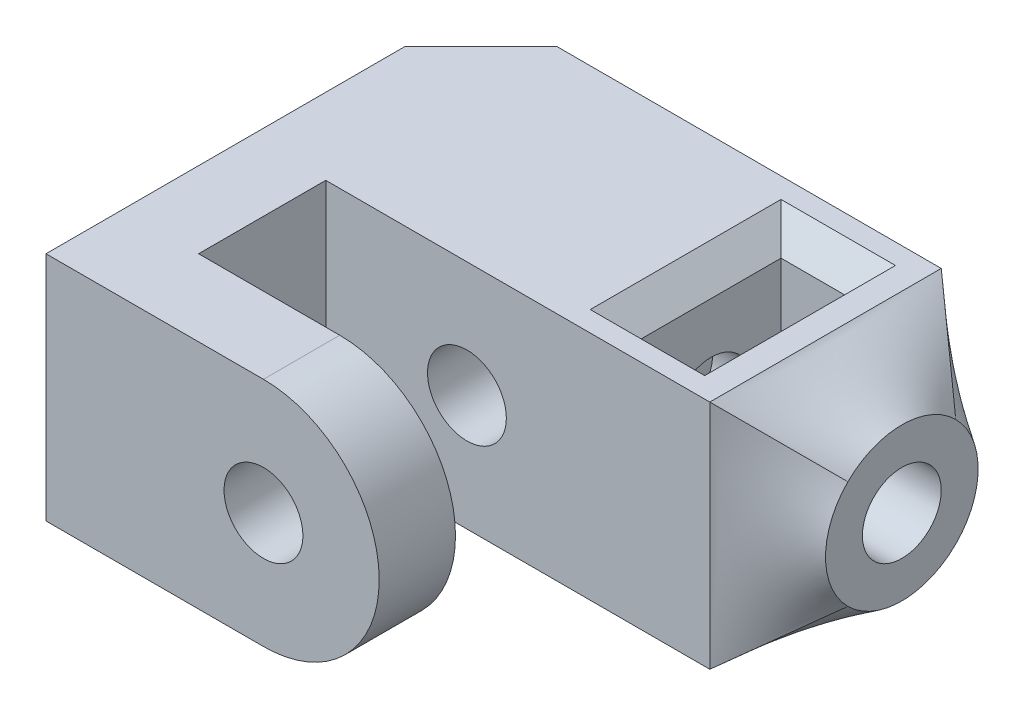
ISO-10303-21;
HEADER;
FILE_DESCRIPTION(('STEP AP214'),'2;1');
FILE_NAME('part.step','',(''),(''),'','','');
FILE_SCHEMA(('AUTOMOTIVE_DESIGN { 1 0 10303 214 1 1 1 1 }'));
ENDSEC;
DATA;
#1=APPLICATION_CONTEXT('core data for automotive mechanical design processes');
#2=APPLICATION_PROTOCOL_DEFINITION('international standard','automotive_design',2000,#1);
#3=PRODUCT_CONTEXT('',#1,'mechanical');
#4=PRODUCT('Part','Part','',(#3));
#5=PRODUCT_RELATED_PRODUCT_CATEGORY('part','',(#4));
#6=PRODUCT_DEFINITION_FORMATION('','',#4);
#7=PRODUCT_DEFINITION_CONTEXT('part definition',#1,'design');
#8=PRODUCT_DEFINITION('design','',#6,#7);
#9=PRODUCT_DEFINITION_SHAPE('','',#8);
#10=(LENGTH_UNIT() NAMED_UNIT(*) SI_UNIT(.MILLI.,.METRE.));
#11=(NAMED_UNIT(*) PLANE_ANGLE_UNIT() SI_UNIT($,.RADIAN.));
#12=(NAMED_UNIT(*) SI_UNIT($,.STERADIAN.) SOLID_ANGLE_UNIT());
#13=UNCERTAINTY_MEASURE_WITH_UNIT(LENGTH_MEASURE(1.E-05),#10,'distance_accuracy_value','');
#14=(GEOMETRIC_REPRESENTATION_CONTEXT(3) GLOBAL_UNCERTAINTY_ASSIGNED_CONTEXT((#13)) GLOBAL_UNIT_ASSIGNED_CONTEXT((#10,
#11,#12)) REPRESENTATION_CONTEXT('',''));
#15=CARTESIAN_POINT('',(0.,0.,0.));
#16=DIRECTION('',(0.,0.,1.));
#17=DIRECTION('',(1.,0.,0.));
#18=AXIS2_PLACEMENT_3D('',#15,#16,#17);
#19=CARTESIAN_POINT('',(-107.11518965689,2.50000000001586,-20.55));
#20=DIRECTION('',(1.,0.,0.));
#21=DIRECTION('',(0.,0.,1.));
#22=AXIS2_PLACEMENT_3D('',#19,#20,#21);
#23=CYLINDRICAL_SURFACE('',#22,1.55);
#24=CARTESIAN_POINT('',(-82.0141896568897,2.50000000001586,-20.55));
#25=DIRECTION('',(-1.,0.,0.));
#26=DIRECTION('',(0.,0.,1.));
#27=AXIS2_PLACEMENT_3D('',#24,#25,#26);
#28=CIRCLE('',#27,1.55);
#29=CARTESIAN_POINT('',(-82.0141896568897,2.50000000001586,-19.));
#30=VERTEX_POINT('',#29);
#31=EDGE_CURVE('E190',#30,#30,#28,.T.);
#32=ORIENTED_EDGE('',*,*,#31,.F.);
#33=EDGE_LOOP('',(#32));
#34=FACE_BOUND('',#33,.T.);
#35=CARTESIAN_POINT('',(-87.0141896568897,2.50000000001586,-20.55));
#36=DIRECTION('',(1.,0.,0.));
#37=DIRECTION('',(0.,0.,-1.));
#38=AXIS2_PLACEMENT_3D('',#35,#36,#37);
#39=CIRCLE('',#38,1.55);
#40=CARTESIAN_POINT('',(-87.0141896568897,2.50000000001586,-22.1));
#41=VERTEX_POINT('',#40);
#42=EDGE_CURVE('E369',#41,#41,#39,.T.);
#43=ORIENTED_EDGE('',*,*,#42,.F.);
#44=EDGE_LOOP('',(#43));
#45=FACE_BOUND('',#44,.T.);
#46=ADVANCED_FACE('F39',(#34,#45),#23,.F.);
#47=CARTESIAN_POINT('',(-100.11418965689,0.,-16.));
#48=DIRECTION('',(-1.,0.,0.));
#49=DIRECTION('',(0.,0.,-1.));
#50=AXIS2_PLACEMENT_3D('',#47,#48,#49);
#51=PLANE('',#50);
#52=DIRECTION('',(0.,1.,0.));
#53=VECTOR('',#52,1.);
#54=CARTESIAN_POINT('',(-100.11418965689,0.,-11.));
#55=LINE('',#54,#53);
#56=CARTESIAN_POINT('',(-100.11418965689,-2.04999999998414,-11.));
#57=VERTEX_POINT('',#56);
#58=CARTESIAN_POINT('',(-100.11418965689,7.05000000001586,-11.));
#59=VERTEX_POINT('',#58);
#60=EDGE_CURVE('E285',#57,#59,#55,.T.);
#61=ORIENTED_EDGE('',*,*,#60,.F.);
#62=DIRECTION('',(0.,0.,-1.));
#63=VECTOR('',#62,1.);
#64=CARTESIAN_POINT('',(-100.11418965689,-2.04999999998414,-8.));
#65=LINE('',#64,#63);
#66=CARTESIAN_POINT('',(-100.11418965689,-2.04999999998414,-16.));
#67=VERTEX_POINT('',#66);
#68=EDGE_CURVE('E295',#57,#67,#65,.T.);
#69=ORIENTED_EDGE('',*,*,#68,.T.);
#70=DIRECTION('',(0.,-1.,0.));
#71=VECTOR('',#70,1.);
#72=CARTESIAN_POINT('',(-100.11418965689,0.,-16.));
#73=LINE('',#72,#71);
#74=CARTESIAN_POINT('',(-100.11418965689,7.05000000001586,-16.));
#75=VERTEX_POINT('',#74);
#76=EDGE_CURVE('E412',#75,#67,#73,.T.);
#77=ORIENTED_EDGE('',*,*,#76,.F.);
#78=DIRECTION('',(0.,0.,1.));
#79=VECTOR('',#78,1.);
#80=CARTESIAN_POINT('',(-100.11418965689,7.05000000001586,-8.));
#81=LINE('',#80,#79);
#82=EDGE_CURVE('E299',#75,#59,#81,.T.);
#83=ORIENTED_EDGE('',*,*,#82,.T.);
#84=EDGE_LOOP('',(#61,#69,#77,#83));
#85=FACE_BOUND('',#84,.T.);
#86=ADVANCED_FACE('F485',(#85),#51,.F.);
#87=CARTESIAN_POINT('',(0.,7.05000000001582,-25.1));
#88=DIRECTION('',(0.,1.,0.));
#89=DIRECTION('',(-1.,0.,0.));
#90=AXIS2_PLACEMENT_3D('',#87,#88,#89);
#91=PLANE('',#90);
#92=DIRECTION('',(0.,0.,1.));
#93=VECTOR('',#92,1.);
#94=CARTESIAN_POINT('',(-90.5141896568897,7.05000000001586,-17.8));
#95=LINE('',#94,#93);
#96=CARTESIAN_POINT('',(-90.5141896568897,7.05000000001586,-24.3));
#97=VERTEX_POINT('',#96);
#98=CARTESIAN_POINT('',(-90.5141896568897,7.05000000001586,-16.8));
#99=VERTEX_POINT('',#98);
#100=EDGE_CURVE('E326',#97,#99,#95,.T.);
#101=ORIENTED_EDGE('',*,*,#100,.F.);
#102=DIRECTION('',(-1.,0.,0.));
#103=VECTOR('',#102,1.);
#104=CARTESIAN_POINT('',(0.,7.05000000001582,-24.3));
#105=LINE('',#104,#103);
#106=CARTESIAN_POINT('',(-86.0141896568897,7.05000000001585,-24.3));
#107=VERTEX_POINT('',#106);
#108=EDGE_CURVE('E339',#107,#97,#105,.T.);
#109=ORIENTED_EDGE('',*,*,#108,.F.);
#110=DIRECTION('',(0.,0.,-1.));
#111=VECTOR('',#110,1.);
#112=CARTESIAN_POINT('',(-86.0141896568897,7.05000000001585,-25.1));
#113=LINE('',#112,#111);
#114=CARTESIAN_POINT('',(-86.0141896568897,7.05000000001586,-16.8));
#115=VERTEX_POINT('',#114);
#116=EDGE_CURVE('E342',#115,#107,#113,.T.);
#117=ORIENTED_EDGE('',*,*,#116,.F.);
#118=DIRECTION('',(1.,0.,0.));
#119=VECTOR('',#118,1.);
#120=CARTESIAN_POINT('',(0.,7.05000000001583,-16.8));
#121=LINE('',#120,#119);
#122=EDGE_CURVE('E345',#99,#115,#121,.T.);
#123=ORIENTED_EDGE('',*,*,#122,.F.);
#124=EDGE_LOOP('',(#101,#109,#117,#123));
#125=FACE_BOUND('',#124,.T.);
#126=DIRECTION('',(0.,0.,1.));
#127=VECTOR('',#126,1.);
#128=CARTESIAN_POINT('',(-103.11418965689,7.05000000001586,-8.));
#129=LINE('',#128,#127);
#130=CARTESIAN_POINT('',(-103.11418965689,7.05000000001586,-22.1));
#131=VERTEX_POINT('',#130);
#132=CARTESIAN_POINT('',(-103.11418965689,7.05000000001586,-8.));
#133=VERTEX_POINT('',#132);
#134=EDGE_CURVE('E302',#131,#133,#129,.T.);
#135=ORIENTED_EDGE('',*,*,#134,.T.);
#136=DIRECTION('',(1.,0.,0.));
#137=VECTOR('',#136,1.);
#138=CARTESIAN_POINT('',(-103.11418965689,7.05000000001586,-8.));
#139=LINE('',#138,#137);
#140=CARTESIAN_POINT('',(-94.5641896568897,7.05000000001586,-8.));
#141=VERTEX_POINT('',#140);
#142=EDGE_CURVE('E305',#133,#141,#139,.T.);
#143=ORIENTED_EDGE('',*,*,#142,.T.);
#144=DIRECTION('',(0.,0.,-1.));
#145=VECTOR('',#144,1.);
#146=CARTESIAN_POINT('',(-94.5641896568897,7.05000000001586,-8.));
#147=LINE('',#146,#145);
#148=CARTESIAN_POINT('',(-94.5641896568897,7.05000000001586,-11.));
#149=VERTEX_POINT('',#148);
#150=EDGE_CURVE('E292',#141,#149,#147,.T.);
#151=ORIENTED_EDGE('',*,*,#150,.T.);
#152=DIRECTION('',(1.,0.,0.));
#153=VECTOR('',#152,1.);
#154=CARTESIAN_POINT('',(0.,7.05000000001586,-11.));
#155=LINE('',#154,#153);
#156=EDGE_CURVE('E277',#59,#149,#155,.T.);
#157=ORIENTED_EDGE('',*,*,#156,.F.);
#158=ORIENTED_EDGE('',*,*,#82,.F.);
#159=DIRECTION('',(1.,0.,0.));
#160=VECTOR('',#159,1.);
#161=CARTESIAN_POINT('',(0.,7.05000000001583,-16.));
#162=LINE('',#161,#160);
#163=CARTESIAN_POINT('',(-85.0141896568897,7.05000000001586,-16.));
#164=VERTEX_POINT('',#163);
#165=EDGE_CURVE('E401',#75,#164,#162,.T.);
#166=ORIENTED_EDGE('',*,*,#165,.T.);
#167=DIRECTION('',(0.,0.,-1.));
#168=VECTOR('',#167,1.);
#169=CARTESIAN_POINT('',(-85.0141896568897,7.05000000001585,-25.1));
#170=LINE('',#169,#168);
#171=CARTESIAN_POINT('',(-85.0141896568897,7.05000000001585,-25.1));
#172=VERTEX_POINT('',#171);
#173=EDGE_CURVE('E327',#172,#164,#170,.F.);
#174=ORIENTED_EDGE('',*,*,#173,.F.);
#175=DIRECTION('',(1.,0.,0.));
#176=VECTOR('',#175,1.);
#177=CARTESIAN_POINT('',(0.,7.05000000001582,-25.1));
#178=LINE('',#177,#176);
#179=CARTESIAN_POINT('',(-100.11418965689,7.05000000001586,-25.1));
#180=VERTEX_POINT('',#179);
#181=EDGE_CURVE('E316',#180,#172,#178,.T.);
#182=ORIENTED_EDGE('',*,*,#181,.F.);
#183=DIRECTION('',(-0.707106781186548,0.,0.707106781186547));
#184=VECTOR('',#183,1.);
#185=CARTESIAN_POINT('',(-50.0570948284447,7.05000000001582,-75.1570948284448));
#186=LINE('',#185,#184);
#187=EDGE_CURVE('E371',#131,#180,#186,.F.);
#188=ORIENTED_EDGE('',*,*,#187,.F.);
#189=EDGE_LOOP('',(#135,#143,#151,#157,#158,#166,#174,#182,#188));
#190=FACE_BOUND('',#189,.T.);
#191=ADVANCED_FACE('F377',(#125,#190),#91,.T.);
#192=CARTESIAN_POINT('',(0.,-2.04999999998411,-25.1));
#193=DIRECTION('',(0.,1.,0.));
#194=DIRECTION('',(-1.,0.,0.));
#195=AXIS2_PLACEMENT_3D('',#192,#193,#194);
#196=PLANE('',#195);
#197=DIRECTION('',(1.,0.,0.));
#198=VECTOR('',#197,1.);
#199=CARTESIAN_POINT('',(0.,-2.04999999998411,-25.1));
#200=LINE('',#199,#198);
#201=CARTESIAN_POINT('',(-100.11418965689,-2.04999999998415,-25.1));
#202=VERTEX_POINT('',#201);
#203=CARTESIAN_POINT('',(-85.0141896568897,-2.04999999998414,-25.1));
#204=VERTEX_POINT('',#203);
#205=EDGE_CURVE('E318',#202,#204,#200,.T.);
#206=ORIENTED_EDGE('',*,*,#205,.T.);
#207=DIRECTION('',(0.,0.,-1.));
#208=VECTOR('',#207,1.);
#209=CARTESIAN_POINT('',(-85.0141896568897,-2.04999999998414,-25.1));
#210=LINE('',#209,#208);
#211=CARTESIAN_POINT('',(-85.0141896568897,-2.04999999998414,-16.));
#212=VERTEX_POINT('',#211);
#213=EDGE_CURVE('E323',#204,#212,#210,.F.);
#214=ORIENTED_EDGE('',*,*,#213,.T.);
#215=DIRECTION('',(1.,0.,0.));
#216=VECTOR('',#215,1.);
#217=CARTESIAN_POINT('',(0.,-2.04999999998411,-16.));
#218=LINE('',#217,#216);
#219=EDGE_CURVE('E331',#67,#212,#218,.T.);
#220=ORIENTED_EDGE('',*,*,#219,.F.);
#221=ORIENTED_EDGE('',*,*,#68,.F.);
#222=DIRECTION('',(-1.,0.,0.));
#223=VECTOR('',#222,1.);
#224=CARTESIAN_POINT('',(0.,-2.04999999998414,-11.));
#225=LINE('',#224,#223);
#226=CARTESIAN_POINT('',(-94.5641896568897,-2.04999999998414,-11.));
#227=VERTEX_POINT('',#226);
#228=EDGE_CURVE('E283',#227,#57,#225,.T.);
#229=ORIENTED_EDGE('',*,*,#228,.F.);
#230=DIRECTION('',(0.,0.,-1.));
#231=VECTOR('',#230,1.);
#232=CARTESIAN_POINT('',(-94.5641896568897,-2.04999999998414,-8.));
#233=LINE('',#232,#231);
#234=CARTESIAN_POINT('',(-94.5641896568897,-2.04999999998414,-8.));
#235=VERTEX_POINT('',#234);
#236=EDGE_CURVE('E276',#235,#227,#233,.T.);
#237=ORIENTED_EDGE('',*,*,#236,.F.);
#238=DIRECTION('',(1.,0.,0.));
#239=VECTOR('',#238,1.);
#240=CARTESIAN_POINT('',(-103.11418965689,-2.04999999998414,-8.));
#241=LINE('',#240,#239);
#242=CARTESIAN_POINT('',(-103.11418965689,-2.04999999998414,-8.));
#243=VERTEX_POINT('',#242);
#244=EDGE_CURVE('E394',#243,#235,#241,.T.);
#245=ORIENTED_EDGE('',*,*,#244,.F.);
#246=DIRECTION('',(0.,0.,-1.));
#247=VECTOR('',#246,1.);
#248=CARTESIAN_POINT('',(-103.11418965689,-2.04999999998414,-8.));
#249=LINE('',#248,#247);
#250=CARTESIAN_POINT('',(-103.11418965689,-2.04999999998415,-22.1));
#251=VERTEX_POINT('',#250);
#252=EDGE_CURVE('E298',#243,#251,#249,.T.);
#253=ORIENTED_EDGE('',*,*,#252,.T.);
#254=DIRECTION('',(0.707106781186548,0.,-0.707106781186547));
#255=VECTOR('',#254,1.);
#256=CARTESIAN_POINT('',(-103.11418965689,-2.04999999998415,-22.1));
#257=LINE('',#256,#255);
#258=EDGE_CURVE('E12',#202,#251,#257,.F.);
#259=ORIENTED_EDGE('',*,*,#258,.F.);
#260=EDGE_LOOP('',(#206,#214,#220,#221,#229,#237,#245,#253,#259));
#261=FACE_BOUND('',#260,.T.);
#262=ADVANCED_FACE('F389',(#261),#196,.F.);
#263=CARTESIAN_POINT('',(-94.5641896568897,2.50000000001586,-25.1));
#264=DIRECTION('',(0.,0.,1.));
#265=DIRECTION('',(-1.,0.,0.));
#266=AXIS2_PLACEMENT_3D('',#263,#264,#265);
#267=CYLINDRICAL_SURFACE('',#266,1.54999999999998);
#268=CARTESIAN_POINT('',(-94.5641896568897,2.50000000001586,-25.1));
#269=DIRECTION('',(0.,0.,1.));
#270=DIRECTION('',(1.,0.,0.));
#271=AXIS2_PLACEMENT_3D('',#268,#269,#270);
#272=CIRCLE('',#271,1.54999999999998);
#273=CARTESIAN_POINT('',(-93.0141896568897,2.50000000001586,-25.1));
#274=VERTEX_POINT('',#273);
#275=EDGE_CURVE('E334',#274,#274,#272,.T.);
#276=ORIENTED_EDGE('',*,*,#275,.F.);
#277=EDGE_LOOP('',(#276));
#278=FACE_BOUND('',#277,.T.);
#279=CARTESIAN_POINT('',(-94.5641896568897,2.50000000001586,-16.));
#280=DIRECTION('',(0.,0.,1.));
#281=DIRECTION('',(1.,0.,0.));
#282=AXIS2_PLACEMENT_3D('',#279,#280,#281);
#283=CIRCLE('',#282,1.54999999999998);
#284=CARTESIAN_POINT('',(-93.0141896568897,2.50000000001586,-16.));
#285=VERTEX_POINT('',#284);
#286=EDGE_CURVE('E319',#285,#285,#283,.T.);
#287=ORIENTED_EDGE('',*,*,#286,.T.);
#288=EDGE_LOOP('',(#287));
#289=FACE_BOUND('',#288,.T.);
#290=ADVANCED_FACE('F493',(#278,#289),#267,.F.);
#291=CARTESIAN_POINT('',(0.,0.,-25.1));
#292=DIRECTION('',(0.,0.,-1.));
#293=DIRECTION('',(1.,0.,0.));
#294=AXIS2_PLACEMENT_3D('',#291,#292,#293);
#295=PLANE('',#294);
#296=ORIENTED_EDGE('',*,*,#181,.T.);
#297=DIRECTION('',(0.,1.,0.));
#298=VECTOR('',#297,1.);
#299=CARTESIAN_POINT('',(-85.0141896568897,0.,-25.1));
#300=LINE('',#299,#298);
#301=EDGE_CURVE('E322',#204,#172,#300,.T.);
#302=ORIENTED_EDGE('',*,*,#301,.F.);
#303=ORIENTED_EDGE('',*,*,#205,.F.);
#304=DIRECTION('',(0.,-1.,0.));
#305=VECTOR('',#304,1.);
#306=CARTESIAN_POINT('',(-100.11418965689,0.,-25.1));
#307=LINE('',#306,#305);
#308=EDGE_CURVE('E47',#180,#202,#307,.T.);
#309=ORIENTED_EDGE('',*,*,#308,.F.);
#310=EDGE_LOOP('',(#296,#302,#303,#309));
#311=FACE_BOUND('',#310,.T.);
#312=ORIENTED_EDGE('',*,*,#275,.T.);
#313=EDGE_LOOP('',(#312));
#314=FACE_BOUND('',#313,.T.);
#315=ADVANCED_FACE('F380',(#311,#314),#295,.T.);
#316=CARTESIAN_POINT('',(0.,0.,-16.));
#317=DIRECTION('',(0.,0.,-1.));
#318=DIRECTION('',(1.,0.,0.));
#319=AXIS2_PLACEMENT_3D('',#316,#317,#318);
#320=PLANE('',#319);
#321=ORIENTED_EDGE('',*,*,#165,.F.);
#322=ORIENTED_EDGE('',*,*,#76,.T.);
#323=ORIENTED_EDGE('',*,*,#219,.T.);
#324=DIRECTION('',(0.,1.,0.));
#325=VECTOR('',#324,1.);
#326=CARTESIAN_POINT('',(-85.0141896568897,0.,-16.));
#327=LINE('',#326,#325);
#328=EDGE_CURVE('E328',#212,#164,#327,.T.);
#329=ORIENTED_EDGE('',*,*,#328,.T.);
#330=EDGE_LOOP('',(#321,#322,#323,#329));
#331=FACE_BOUND('',#330,.T.);
#332=ORIENTED_EDGE('',*,*,#286,.F.);
#333=EDGE_LOOP('',(#332));
#334=FACE_BOUND('',#333,.T.);
#335=ADVANCED_FACE('F419',(#331,#334),#320,.F.);
#336=CARTESIAN_POINT('',(-103.11418965689,7.05000000001586,-8.));
#337=DIRECTION('',(0.,0.,-1.));
#338=DIRECTION('',(0.,-1.,0.));
#339=AXIS2_PLACEMENT_3D('',#336,#337,#338);
#340=PLANE('',#339);
#341=ORIENTED_EDGE('',*,*,#142,.F.);
#342=DIRECTION('',(0.,-1.,0.));
#343=VECTOR('',#342,1.);
#344=CARTESIAN_POINT('',(-103.11418965689,7.05000000001586,-8.));
#345=LINE('',#344,#343);
#346=EDGE_CURVE('E296',#133,#243,#345,.T.);
#347=ORIENTED_EDGE('',*,*,#346,.T.);
#348=ORIENTED_EDGE('',*,*,#244,.T.);
#349=CARTESIAN_POINT('',(-94.5641896568897,2.50000000001586,-8.));
#350=DIRECTION('',(0.,0.,-1.));
#351=DIRECTION('',(-1.,0.,0.));
#352=AXIS2_PLACEMENT_3D('',#349,#350,#351);
#353=CIRCLE('',#352,4.55);
#354=EDGE_CURVE('E265',#141,#235,#353,.T.);
#355=ORIENTED_EDGE('',*,*,#354,.F.);
#356=EDGE_LOOP('',(#341,#347,#348,#355));
#357=FACE_BOUND('',#356,.T.);
#358=CARTESIAN_POINT('',(-94.5641896568897,2.50000000001586,-8.));
#359=DIRECTION('',(0.,0.,-1.));
#360=DIRECTION('',(-1.,0.,0.));
#361=AXIS2_PLACEMENT_3D('',#358,#359,#360);
#362=CIRCLE('',#361,1.54999999999998);
#363=CARTESIAN_POINT('',(-96.1141896568897,2.50000000001586,-8.));
#364=VERTEX_POINT('',#363);
#365=EDGE_CURVE('E272',#364,#364,#362,.T.);
#366=ORIENTED_EDGE('',*,*,#365,.T.);
#367=EDGE_LOOP('',(#366));
#368=FACE_BOUND('',#367,.T.);
#369=ADVANCED_FACE('F484',(#357,#368),#340,.F.);
#370=CARTESIAN_POINT('',(-103.11418965689,0.,-16.));
#371=DIRECTION('',(-1.,0.,0.));
#372=DIRECTION('',(0.,0.,-1.));
#373=AXIS2_PLACEMENT_3D('',#370,#371,#372);
#374=PLANE('',#373);
#375=ORIENTED_EDGE('',*,*,#252,.F.);
#376=ORIENTED_EDGE('',*,*,#346,.F.);
#377=ORIENTED_EDGE('',*,*,#134,.F.);
#378=DIRECTION('',(0.,1.,0.));
#379=VECTOR('',#378,1.);
#380=CARTESIAN_POINT('',(-103.11418965689,0.,-22.1));
#381=LINE('',#380,#379);
#382=EDGE_CURVE('E360',#251,#131,#381,.T.);
#383=ORIENTED_EDGE('',*,*,#382,.F.);
#384=EDGE_LOOP('',(#375,#376,#377,#383));
#385=FACE_BOUND('',#384,.T.);
#386=ADVANCED_FACE('F396',(#385),#374,.T.);
#387=CARTESIAN_POINT('',(-94.5641896568897,2.50000000001586,-8.));
#388=DIRECTION('',(0.,0.,-1.));
#389=DIRECTION('',(1.,0.,0.));
#390=AXIS2_PLACEMENT_3D('',#387,#388,#389);
#391=CYLINDRICAL_SURFACE('',#390,4.55);
#392=CARTESIAN_POINT('',(-94.5641896568897,2.50000000001586,-11.));
#393=DIRECTION('',(0.,0.,-1.));
#394=DIRECTION('',(-1.,0.,0.));
#395=AXIS2_PLACEMENT_3D('',#392,#393,#394);
#396=CIRCLE('',#395,4.55);
#397=EDGE_CURVE('E280',#149,#227,#396,.T.);
#398=ORIENTED_EDGE('',*,*,#397,.F.);
#399=ORIENTED_EDGE('',*,*,#150,.F.);
#400=ORIENTED_EDGE('',*,*,#354,.T.);
#401=ORIENTED_EDGE('',*,*,#236,.T.);
#402=EDGE_LOOP('',(#398,#399,#400,#401));
#403=FACE_BOUND('',#402,.T.);
#404=ADVANCED_FACE('F477',(#403),#391,.T.);
#405=CARTESIAN_POINT('',(-94.5641896568897,2.50000000001586,-8.));
#406=DIRECTION('',(0.,0.,-1.));
#407=DIRECTION('',(1.,0.,0.));
#408=AXIS2_PLACEMENT_3D('',#405,#406,#407);
#409=CYLINDRICAL_SURFACE('',#408,1.54999999999998);
#410=ORIENTED_EDGE('',*,*,#365,.F.);
#411=EDGE_LOOP('',(#410));
#412=FACE_BOUND('',#411,.T.);
#413=CARTESIAN_POINT('',(-94.5641896568897,2.50000000001586,-11.));
#414=DIRECTION('',(0.,0.,-1.));
#415=DIRECTION('',(-1.,0.,0.));
#416=AXIS2_PLACEMENT_3D('',#413,#414,#415);
#417=CIRCLE('',#416,1.54999999999998);
#418=CARTESIAN_POINT('',(-96.1141896568897,2.50000000001586,-11.));
#419=VERTEX_POINT('',#418);
#420=EDGE_CURVE('E273',#419,#419,#417,.T.);
#421=ORIENTED_EDGE('',*,*,#420,.T.);
#422=EDGE_LOOP('',(#421));
#423=FACE_BOUND('',#422,.T.);
#424=ADVANCED_FACE('F473',(#412,#423),#409,.F.);
#425=CARTESIAN_POINT('',(0.,0.,-11.));
#426=DIRECTION('',(0.,0.,1.));
#427=DIRECTION('',(-1.,0.,0.));
#428=AXIS2_PLACEMENT_3D('',#425,#426,#427);
#429=PLANE('',#428);
#430=ORIENTED_EDGE('',*,*,#156,.T.);
#431=ORIENTED_EDGE('',*,*,#397,.T.);
#432=ORIENTED_EDGE('',*,*,#228,.T.);
#433=ORIENTED_EDGE('',*,*,#60,.T.);
#434=EDGE_LOOP('',(#430,#431,#432,#433));
#435=FACE_BOUND('',#434,.T.);
#436=ORIENTED_EDGE('',*,*,#420,.F.);
#437=EDGE_LOOP('',(#436));
#438=FACE_BOUND('',#437,.T.);
#439=ADVANCED_FACE('F222',(#435,#438),#429,.F.);
#440=CARTESIAN_POINT('',(-82.0141896568897,2.50000000001586,-20.55));
#441=DIRECTION('',(1.,0.,0.));
#442=DIRECTION('',(0.,0.,1.));
#443=AXIS2_PLACEMENT_3D('',#440,#441,#442);
#444=PLANE('',#443);
#445=ORIENTED_EDGE('',*,*,#31,.T.);
#446=EDGE_LOOP('',(#445));
#447=FACE_BOUND('',#446,.T.);
#448=CARTESIAN_POINT('',(-82.0141896568897,2.50000000001586,-20.55));
#449=DIRECTION('',(-1.,0.,0.));
#450=DIRECTION('',(0.,0.,1.));
#451=AXIS2_PLACEMENT_3D('',#448,#449,#450);
#452=CIRCLE('',#451,3.);
#453=CARTESIAN_POINT('',(-82.0141896568897,0.378679656456214,-18.4286796564404));
#454=VERTEX_POINT('',#453);
#455=CARTESIAN_POINT('',(-82.0141896568897,4.6213203435755,-18.4286796564404));
#456=VERTEX_POINT('',#455);
#457=EDGE_CURVE('E281',#454,#456,#452,.T.);
#458=ORIENTED_EDGE('',*,*,#457,.F.);
#459=CARTESIAN_POINT('',(-82.0141896568897,0.378679656456214,-22.6713203435596));
#460=VERTEX_POINT('',#459);
#461=EDGE_CURVE('E257',#460,#454,#452,.T.);
#462=ORIENTED_EDGE('',*,*,#461,.F.);
#463=CARTESIAN_POINT('',(-82.0141896568897,4.6213203435755,-22.6713203435596));
#464=VERTEX_POINT('',#463);
#465=EDGE_CURVE('E248',#464,#460,#452,.T.);
#466=ORIENTED_EDGE('',*,*,#465,.F.);
#467=EDGE_CURVE('E256',#456,#464,#452,.T.);
#468=ORIENTED_EDGE('',*,*,#467,.F.);
#469=EDGE_LOOP('',(#458,#462,#466,#468));
#470=FACE_BOUND('',#469,.T.);
#471=ADVANCED_FACE('F217',(#447,#470),#444,.T.);
#472=CARTESIAN_POINT('',(-85.0141896568897,-2.04999999998414,-25.1));
#473=CARTESIAN_POINT('',(-82.0141896568897,0.378679656456214,-22.6713203435596));
#474=CARTESIAN_POINT('',(-85.0141896568897,-2.04999999998414,-24.3416666666667));
#475=CARTESIAN_POINT('',(-82.0141896568897,0.128679656456214,-22.4213203435596));
#476=CARTESIAN_POINT('',(-85.0141896568897,-2.04999999998414,-23.5833333333333));
#477=CARTESIAN_POINT('',(-82.0141896568897,-0.0954757886155162,-22.1060383272898));
#478=CARTESIAN_POINT('',(-85.0141896568897,-2.04999999998414,-22.0666666666667));
#479=CARTESIAN_POINT('',(-82.0141896568897,-0.410975479348312,-21.3770257577047));
#480=CARTESIAN_POINT('',(-85.0141896568897,-2.04999999998414,-21.3083333333333));
#481=CARTESIAN_POINT('',(-82.0141896568897,-0.499999999984144,-20.9642135623731));
#482=CARTESIAN_POINT('',(-85.0141896568897,-2.04999999998414,-19.7916666666667));
#483=CARTESIAN_POINT('',(-82.0141896568897,-0.499999999984144,-20.1357864376269));
#484=CARTESIAN_POINT('',(-85.0141896568897,-2.04999999998414,-19.0333333333333));
#485=CARTESIAN_POINT('',(-82.0141896568897,-0.410975479348312,-19.7229742422953));
#486=CARTESIAN_POINT('',(-85.0141896568897,-2.04999999998414,-17.5166666666667));
#487=CARTESIAN_POINT('',(-82.0141896568897,-0.0954757886155162,-18.9939616727102));
#488=CARTESIAN_POINT('',(-85.0141896568897,-2.04999999998414,-16.7583333333333));
#489=CARTESIAN_POINT('',(-82.0141896568897,0.128679656456214,-18.6786796564404));
#490=CARTESIAN_POINT('',(-85.0141896568897,-2.04999999998414,-16.));
#491=CARTESIAN_POINT('',(-82.0141896568897,0.378679656456214,-18.4286796564404));
#492=B_SPLINE_SURFACE_WITH_KNOTS('',3,1,((#472,#473),(#474,#475),(#476,#477),(#478,#479),(#480,
#481),(#482,#483),(#484,#485),(#486,#487),(#488,#489),(#490,#491)),.UNSPECIFIED.,.F.,.F.,.F.,(4,
2,2,2,4),(2,2),(0.,0.25,0.5,0.75,1.),(0.,1.),.UNSPECIFIED.);
#493=DIRECTION('',(-0.657841435116081,-0.532562036876651,-0.532562036876651));
#494=VECTOR('',#493,1.);
#495=CARTESIAN_POINT('',(-83.5141896568897,-0.835660171763965,-23.8856601717798));
#496=LINE('',#495,#494);
#497=EDGE_CURVE('E385',#460,#204,#496,.T.);
#498=DIRECTION('',(0.657841435116081,0.53256203687665,-0.532562036876652));
#499=VECTOR('',#498,1.);
#500=CARTESIAN_POINT('',(-83.5141896568897,-0.835660171763963,-17.2143398282202));
#501=LINE('',#500,#499);
#502=EDGE_CURVE('E386',#212,#454,#501,.T.);
#503=ORIENTED_EDGE('',*,*,#213,.F.);
#504=ORIENTED_EDGE('',*,*,#497,.F.);
#505=ORIENTED_EDGE('',*,*,#461,.T.);
#506=ORIENTED_EDGE('',*,*,#502,.F.);
#507=EDGE_LOOP('',(#503,#504,#505,#506));
#508=FACE_BOUND('',#507,.T.);
#509=ADVANCED_FACE('F221',(#508),#492,.F.);
#510=CARTESIAN_POINT('',(-85.0141896568897,-2.04999999998414,-16.));
#511=CARTESIAN_POINT('',(-82.0141896568897,0.378679656456214,-18.4286796564404));
#512=CARTESIAN_POINT('',(-85.0141896568897,-1.29166666665081,-16.));
#513=CARTESIAN_POINT('',(-82.0141896568897,0.628679656456214,-18.1786796564404));
#514=CARTESIAN_POINT('',(-85.0141896568897,-0.533333333317472,-16.));
#515=CARTESIAN_POINT('',(-82.0141896568897,0.943961672726084,-17.9545242113686));
#516=CARTESIAN_POINT('',(-85.0141896568897,0.983333333349195,-16.));
#517=CARTESIAN_POINT('',(-82.0141896568897,1.6729742423112,-17.6390245206358));
#518=CARTESIAN_POINT('',(-85.0141896568897,1.74166666668253,-16.));
#519=CARTESIAN_POINT('',(-82.0141896568897,2.08578643764276,-17.55));
#520=CARTESIAN_POINT('',(-85.0141896568897,3.25833333334919,-16.));
#521=CARTESIAN_POINT('',(-82.0141896568897,2.91421356238895,-17.55));
#522=CARTESIAN_POINT('',(-85.0141896568897,4.01666666668253,-16.));
#523=CARTESIAN_POINT('',(-82.0141896568897,3.32702575772051,-17.6390245206358));
#524=CARTESIAN_POINT('',(-85.0141896568897,5.53333333334919,-16.));
#525=CARTESIAN_POINT('',(-82.0141896568898,4.05603832730563,-17.9545242113686));
#526=CARTESIAN_POINT('',(-85.0141896568897,6.29166666668252,-16.));
#527=CARTESIAN_POINT('',(-82.0141896568897,4.3713203435755,-18.1786796564404));
#528=CARTESIAN_POINT('',(-85.0141896568897,7.05000000001586,-16.));
#529=CARTESIAN_POINT('',(-82.0141896568897,4.6213203435755,-18.4286796564404));
#530=B_SPLINE_SURFACE_WITH_KNOTS('',3,1,((#510,#511),(#512,#513),(#514,#515),(#516,#517),(#518,
#519),(#520,#521),(#522,#523),(#524,#525),(#526,#527),(#528,#529)),.UNSPECIFIED.,.F.,.F.,.F.,(4,
2,2,2,4),(2,2),(0.,0.25,0.5,0.75,1.),(0.,1.),.UNSPECIFIED.);
#531=DIRECTION('',(0.657841435116081,-0.532562036876651,-0.532562036876651));
#532=VECTOR('',#531,1.);
#533=CARTESIAN_POINT('',(-83.5141896568897,5.83566017179568,-17.2143398282202));
#534=LINE('',#533,#532);
#535=EDGE_CURVE('E426',#164,#456,#534,.T.);
#536=ORIENTED_EDGE('',*,*,#328,.F.);
#537=ORIENTED_EDGE('',*,*,#502,.T.);
#538=ORIENTED_EDGE('',*,*,#457,.T.);
#539=ORIENTED_EDGE('',*,*,#535,.F.);
#540=EDGE_LOOP('',(#536,#537,#538,#539));
#541=FACE_BOUND('',#540,.T.);
#542=ADVANCED_FACE('F664',(#541),#530,.F.);
#543=CARTESIAN_POINT('',(-85.0141896568897,7.05000000001585,-25.1));
#544=CARTESIAN_POINT('',(-82.0141896568897,4.6213203435755,-22.6713203435596));
#545=CARTESIAN_POINT('',(-85.0141896568897,6.29166666668252,-25.1));
#546=CARTESIAN_POINT('',(-82.0141896568897,4.3713203435755,-22.9213203435596));
#547=CARTESIAN_POINT('',(-85.0141896568897,5.53333333334919,-25.1));
#548=CARTESIAN_POINT('',(-82.0141896568897,4.05603832730563,-23.1454757886314));
#549=CARTESIAN_POINT('',(-85.0141896568897,4.01666666668253,-25.1));
#550=CARTESIAN_POINT('',(-82.0141896568897,3.32702575772051,-23.4609754793642));
#551=CARTESIAN_POINT('',(-85.0141896568897,3.25833333334919,-25.1));
#552=CARTESIAN_POINT('',(-82.0141896568897,2.91421356238895,-23.55));
#553=CARTESIAN_POINT('',(-85.0141896568897,1.74166666668253,-25.1));
#554=CARTESIAN_POINT('',(-82.0141896568897,2.08578643764276,-23.55));
#555=CARTESIAN_POINT('',(-85.0141896568897,0.983333333349194,-25.1));
#556=CARTESIAN_POINT('',(-82.0141896568897,1.6729742423112,-23.4609754793642));
#557=CARTESIAN_POINT('',(-85.0141896568897,-0.533333333317474,-25.1));
#558=CARTESIAN_POINT('',(-82.0141896568897,0.943961672726084,-23.1454757886314));
#559=CARTESIAN_POINT('',(-85.0141896568897,-1.29166666665081,-25.1));
#560=CARTESIAN_POINT('',(-82.0141896568897,0.628679656456214,-22.9213203435596));
#561=CARTESIAN_POINT('',(-85.0141896568897,-2.04999999998414,-25.1));
#562=CARTESIAN_POINT('',(-82.0141896568897,0.378679656456214,-22.6713203435596));
#563=B_SPLINE_SURFACE_WITH_KNOTS('',3,1,((#543,#544),(#545,#546),(#547,#548),(#549,#550),(#551,
#552),(#553,#554),(#555,#556),(#557,#558),(#559,#560),(#561,#562)),.UNSPECIFIED.,.F.,.F.,.F.,(4,
2,2,2,4),(2,2),(0.,0.25,0.5,0.75,1.),(0.,1.),.UNSPECIFIED.);
#564=DIRECTION('',(0.657841435116081,-0.532562036876651,0.532562036876651));
#565=VECTOR('',#564,1.);
#566=CARTESIAN_POINT('',(-83.5141896568897,5.83566017179568,-23.8856601717798));
#567=LINE('',#566,#565);
#568=EDGE_CURVE('E205',#172,#464,#567,.T.);
#569=ORIENTED_EDGE('',*,*,#301,.T.);
#570=ORIENTED_EDGE('',*,*,#568,.T.);
#571=ORIENTED_EDGE('',*,*,#465,.T.);
#572=ORIENTED_EDGE('',*,*,#497,.T.);
#573=EDGE_LOOP('',(#569,#570,#571,#572));
#574=FACE_BOUND('',#573,.T.);
#575=ADVANCED_FACE('F462',(#574),#563,.F.);
#576=CARTESIAN_POINT('',(-85.0141896568897,7.05000000001586,-16.));
#577=CARTESIAN_POINT('',(-82.0141896568897,4.6213203435755,-18.4286796564404));
#578=CARTESIAN_POINT('',(-85.0141896568897,7.05000000001586,-16.7583333333333));
#579=CARTESIAN_POINT('',(-82.0141896568897,4.8713203435755,-18.6786796564404));
#580=CARTESIAN_POINT('',(-85.0141896568897,7.05000000001586,-17.5166666666667));
#581=CARTESIAN_POINT('',(-82.0141896568897,5.09547578864723,-18.9939616727102));
#582=CARTESIAN_POINT('',(-85.0141896568897,7.05000000001586,-19.0333333333333));
#583=CARTESIAN_POINT('',(-82.0141896568897,5.41097547938002,-19.7229742422953));
#584=CARTESIAN_POINT('',(-85.0141896568897,7.05000000001585,-19.7916666666667));
#585=CARTESIAN_POINT('',(-82.0141896568897,5.50000000001586,-20.1357864376269));
#586=CARTESIAN_POINT('',(-85.0141896568897,7.05000000001585,-21.3083333333333));
#587=CARTESIAN_POINT('',(-82.0141896568897,5.50000000001585,-20.9642135623731));
#588=CARTESIAN_POINT('',(-85.0141896568897,7.05000000001585,-22.0666666666667));
#589=CARTESIAN_POINT('',(-82.0141896568897,5.41097547938003,-21.3770257577047));
#590=CARTESIAN_POINT('',(-85.0141896568897,7.05000000001585,-23.5833333333333));
#591=CARTESIAN_POINT('',(-82.0141896568897,5.09547578864723,-22.1060383272898));
#592=CARTESIAN_POINT('',(-85.0141896568897,7.05000000001585,-24.3416666666667));
#593=CARTESIAN_POINT('',(-82.0141896568897,4.8713203435755,-22.4213203435596));
#594=CARTESIAN_POINT('',(-85.0141896568897,7.05000000001585,-25.1));
#595=CARTESIAN_POINT('',(-82.0141896568897,4.6213203435755,-22.6713203435596));
#596=B_SPLINE_SURFACE_WITH_KNOTS('',3,1,((#576,#577),(#578,#579),(#580,#581),(#582,#583),(#584,
#585),(#586,#587),(#588,#589),(#590,#591),(#592,#593),(#594,#595)),.UNSPECIFIED.,.F.,.F.,.F.,(4,
2,2,2,4),(2,2),(0.,0.25,0.5,0.75,1.),(0.,1.),.UNSPECIFIED.);
#597=ORIENTED_EDGE('',*,*,#173,.T.);
#598=ORIENTED_EDGE('',*,*,#535,.T.);
#599=ORIENTED_EDGE('',*,*,#467,.T.);
#600=ORIENTED_EDGE('',*,*,#568,.F.);
#601=EDGE_LOOP('',(#597,#598,#599,#600));
#602=FACE_BOUND('',#601,.T.);
#603=ADVANCED_FACE('F424',(#602),#596,.F.);
#604=CARTESIAN_POINT('',(-89.5141896568897,1.46363793321427,-16.8450317547374));
#605=DIRECTION('',(0.,0.866025403784438,-0.5));
#606=DIRECTION('',(0.,-0.5,-0.866025403784438));
#607=AXIS2_PLACEMENT_3D('',#604,#605,#606);
#608=PLANE('',#607);
#609=DIRECTION('',(0.,-0.5,-0.866025403784438));
#610=VECTOR('',#609,1.);
#611=CARTESIAN_POINT('',(-87.0141896568897,1.46363793321427,-16.8450317547374));
#612=LINE('',#611,#610);
#613=CARTESIAN_POINT('',(-87.0141896568897,0.912286759744374,-17.8));
#614=VERTEX_POINT('',#613);
#615=CARTESIAN_POINT('',(-87.0141896568897,-0.67542648052711,-20.55));
#616=VERTEX_POINT('',#615);
#617=EDGE_CURVE('E189',#614,#616,#612,.T.);
#618=ORIENTED_EDGE('',*,*,#617,.T.);
#619=DIRECTION('',(1.,0.,0.));
#620=VECTOR('',#619,1.);
#621=CARTESIAN_POINT('',(-89.5141896568897,-0.67542648052711,-20.55));
#622=LINE('',#621,#620);
#623=CARTESIAN_POINT('',(-89.5141896568897,-0.67542648052711,-20.55));
#624=VERTEX_POINT('',#623);
#625=EDGE_CURVE('E168',#624,#616,#622,.T.);
#626=ORIENTED_EDGE('',*,*,#625,.F.);
#627=DIRECTION('',(0.,-0.5,-0.866025403784438));
#628=VECTOR('',#627,1.);
#629=CARTESIAN_POINT('',(-89.5141896568897,1.46363793321427,-16.8450317547374));
#630=LINE('',#629,#628);
#631=CARTESIAN_POINT('',(-89.5141896568897,0.912286759744374,-17.8));
#632=VERTEX_POINT('',#631);
#633=EDGE_CURVE('E175',#632,#624,#630,.T.);
#634=ORIENTED_EDGE('',*,*,#633,.F.);
#635=DIRECTION('',(1.,0.,0.));
#636=VECTOR('',#635,1.);
#637=CARTESIAN_POINT('',(-89.5141896568897,0.912286759744374,-17.8));
#638=LINE('',#637,#636);
#639=EDGE_CURVE('E195',#632,#614,#638,.T.);
#640=ORIENTED_EDGE('',*,*,#639,.T.);
#641=EDGE_LOOP('',(#618,#626,#634,#640));
#642=FACE_BOUND('',#641,.T.);
#643=ADVANCED_FACE('F187',(#642),#608,.T.);
#644=CARTESIAN_POINT('',(-89.5141896568897,-2.47677765400493,-17.4299682452626));
#645=DIRECTION('',(0.,0.866025403784439,0.5));
#646=DIRECTION('',(0.,0.5,-0.866025403784439));
#647=AXIS2_PLACEMENT_3D('',#644,#645,#646);
#648=PLANE('',#647);
#649=DIRECTION('',(0.,0.5,-0.866025403784439));
#650=VECTOR('',#649,1.);
#651=CARTESIAN_POINT('',(-87.0141896568897,-2.47677765400493,-17.4299682452626));
#652=LINE('',#651,#650);
#653=CARTESIAN_POINT('',(-87.0141896568897,0.912286759744372,-23.3));
#654=VERTEX_POINT('',#653);
#655=EDGE_CURVE('E529',#616,#654,#652,.T.);
#656=ORIENTED_EDGE('',*,*,#655,.T.);
#657=DIRECTION('',(1.,0.,0.));
#658=VECTOR('',#657,1.);
#659=CARTESIAN_POINT('',(-89.5141896568897,0.912286759744372,-23.3));
#660=LINE('',#659,#658);
#661=CARTESIAN_POINT('',(-89.5141896568897,0.912286759744372,-23.3));
#662=VERTEX_POINT('',#661);
#663=EDGE_CURVE('E171',#662,#654,#660,.T.);
#664=ORIENTED_EDGE('',*,*,#663,.F.);
#665=DIRECTION('',(0.,0.5,-0.866025403784439));
#666=VECTOR('',#665,1.);
#667=CARTESIAN_POINT('',(-89.5141896568897,-2.47677765400493,-17.4299682452626));
#668=LINE('',#667,#666);
#669=EDGE_CURVE('E163',#624,#662,#668,.T.);
#670=ORIENTED_EDGE('',*,*,#669,.F.);
#671=ORIENTED_EDGE('',*,*,#625,.T.);
#672=EDGE_LOOP('',(#656,#664,#670,#671));
#673=FACE_BOUND('',#672,.T.);
#674=ADVANCED_FACE('F166',(#673),#648,.T.);
#675=CARTESIAN_POINT('',(-89.5141896568897,0.,-23.3));
#676=DIRECTION('',(0.,0.,1.));
#677=DIRECTION('',(-1.,0.,0.));
#678=AXIS2_PLACEMENT_3D('',#675,#676,#677);
#679=PLANE('',#678);
#680=DIRECTION('',(0.,1.,0.));
#681=VECTOR('',#680,1.);
#682=CARTESIAN_POINT('',(-89.5141896568897,0.,-23.3));
#683=LINE('',#682,#681);
#684=CARTESIAN_POINT('',(-89.5141896568897,6.05000000001587,-23.3));
#685=VERTEX_POINT('',#684);
#686=EDGE_CURVE('E174',#662,#685,#683,.T.);
#687=ORIENTED_EDGE('',*,*,#686,.F.);
#688=ORIENTED_EDGE('',*,*,#663,.T.);
#689=DIRECTION('',(0.,1.,0.));
#690=VECTOR('',#689,1.);
#691=CARTESIAN_POINT('',(-87.0141896568897,0.,-23.3));
#692=LINE('',#691,#690);
#693=CARTESIAN_POINT('',(-87.0141896568897,6.05000000001586,-23.3));
#694=VERTEX_POINT('',#693);
#695=EDGE_CURVE('E535',#654,#694,#692,.T.);
#696=ORIENTED_EDGE('',*,*,#695,.T.);
#697=DIRECTION('',(1.,0.,0.));
#698=VECTOR('',#697,1.);
#699=CARTESIAN_POINT('',(-89.5141896568897,6.05000000001586,-23.3));
#700=LINE('',#699,#698);
#701=EDGE_CURVE('E354',#685,#694,#700,.T.);
#702=ORIENTED_EDGE('',*,*,#701,.F.);
#703=EDGE_LOOP('',(#687,#688,#696,#702));
#704=FACE_BOUND('',#703,.T.);
#705=ADVANCED_FACE('F553',(#704),#679,.T.);
#706=CARTESIAN_POINT('',(-89.5141896568897,0.,-17.8));
#707=DIRECTION('',(0.,0.,-1.));
#708=DIRECTION('',(0.,-1.,0.));
#709=AXIS2_PLACEMENT_3D('',#706,#707,#708);
#710=PLANE('',#709);
#711=DIRECTION('',(0.,-1.,0.));
#712=VECTOR('',#711,1.);
#713=CARTESIAN_POINT('',(-87.0141896568897,0.,-17.8));
#714=LINE('',#713,#712);
#715=CARTESIAN_POINT('',(-87.0141896568897,6.05000000001586,-17.8));
#716=VERTEX_POINT('',#715);
#717=EDGE_CURVE('E538',#716,#614,#714,.T.);
#718=ORIENTED_EDGE('',*,*,#717,.T.);
#719=ORIENTED_EDGE('',*,*,#639,.F.);
#720=DIRECTION('',(0.,-1.,0.));
#721=VECTOR('',#720,1.);
#722=CARTESIAN_POINT('',(-89.5141896568897,0.,-17.8));
#723=LINE('',#722,#721);
#724=CARTESIAN_POINT('',(-89.5141896568897,6.05000000001587,-17.8));
#725=VERTEX_POINT('',#724);
#726=EDGE_CURVE('E181',#725,#632,#723,.T.);
#727=ORIENTED_EDGE('',*,*,#726,.F.);
#728=DIRECTION('',(-1.,0.,0.));
#729=VECTOR('',#728,1.);
#730=CARTESIAN_POINT('',(-89.5141896568897,6.05000000001587,-17.8));
#731=LINE('',#730,#729);
#732=EDGE_CURVE('E348',#716,#725,#731,.T.);
#733=ORIENTED_EDGE('',*,*,#732,.F.);
#734=EDGE_LOOP('',(#718,#719,#727,#733));
#735=FACE_BOUND('',#734,.T.);
#736=ADVANCED_FACE('F546',(#735),#710,.T.);
#737=CARTESIAN_POINT('',(-89.5141896568897,0.,-16.));
#738=DIRECTION('',(-1.,0.,0.));
#739=DIRECTION('',(0.,0.,-1.));
#740=AXIS2_PLACEMENT_3D('',#737,#738,#739);
#741=PLANE('',#740);
#742=CARTESIAN_POINT('',(-89.5141896568897,2.50000000001586,-20.55));
#743=DIRECTION('',(1.,0.,0.));
#744=DIRECTION('',(0.,0.,-1.));
#745=AXIS2_PLACEMENT_3D('',#742,#743,#744);
#746=CIRCLE('',#745,1.55);
#747=CARTESIAN_POINT('',(-89.5141896568897,2.50000000001586,-22.1));
#748=VERTEX_POINT('',#747);
#749=EDGE_CURVE('E185',#748,#748,#746,.T.);
#750=ORIENTED_EDGE('',*,*,#749,.F.);
#751=EDGE_LOOP('',(#750));
#752=FACE_BOUND('',#751,.T.);
#753=ORIENTED_EDGE('',*,*,#726,.T.);
#754=ORIENTED_EDGE('',*,*,#633,.T.);
#755=ORIENTED_EDGE('',*,*,#669,.T.);
#756=ORIENTED_EDGE('',*,*,#686,.T.);
#757=DIRECTION('',(0.,0.,-1.));
#758=VECTOR('',#757,1.);
#759=CARTESIAN_POINT('',(-89.5141896568897,6.05000000001587,-23.3));
#760=LINE('',#759,#758);
#761=EDGE_CURVE('E357',#725,#685,#760,.T.);
#762=ORIENTED_EDGE('',*,*,#761,.F.);
#763=EDGE_LOOP('',(#753,#754,#755,#756,#762));
#764=FACE_BOUND('',#763,.T.);
#765=ADVANCED_FACE('F178',(#752,#764),#741,.F.);
#766=CARTESIAN_POINT('',(-87.0141896568897,0.,-16.));
#767=DIRECTION('',(-1.,0.,0.));
#768=DIRECTION('',(0.,0.,-1.));
#769=AXIS2_PLACEMENT_3D('',#766,#767,#768);
#770=PLANE('',#769);
#771=ORIENTED_EDGE('',*,*,#42,.T.);
#772=EDGE_LOOP('',(#771));
#773=FACE_BOUND('',#772,.T.);
#774=ORIENTED_EDGE('',*,*,#695,.F.);
#775=ORIENTED_EDGE('',*,*,#655,.F.);
#776=ORIENTED_EDGE('',*,*,#617,.F.);
#777=ORIENTED_EDGE('',*,*,#717,.F.);
#778=DIRECTION('',(0.,0.,1.));
#779=VECTOR('',#778,1.);
#780=CARTESIAN_POINT('',(-87.0141896568897,6.05000000001587,-16.));
#781=LINE('',#780,#779);
#782=EDGE_CURVE('E351',#694,#716,#781,.T.);
#783=ORIENTED_EDGE('',*,*,#782,.F.);
#784=EDGE_LOOP('',(#774,#775,#776,#777,#783));
#785=FACE_BOUND('',#784,.T.);
#786=ADVANCED_FACE('F545',(#773,#785),#770,.T.);
#787=CARTESIAN_POINT('',(-94.5641896568897,2.50000000001586,-25.1));
#788=DIRECTION('',(0.,0.,1.));
#789=DIRECTION('',(-1.,0.,0.));
#790=AXIS2_PLACEMENT_3D('',#787,#788,#789);
#791=CYLINDRICAL_SURFACE('',#790,3.54999999999998);
#792=CARTESIAN_POINT('',(-91.0141896568897,2.50000000001586,-19.));
#793=CARTESIAN_POINT('',(-91.014192584689,2.58267124635683,-19.0000036124492));
#794=CARTESIAN_POINT('',(-91.0171099068485,2.66547570688113,-19.0066529859001));
#795=CARTESIAN_POINT('',(-91.0284888859173,2.82871073166257,-19.0329908446565));
#796=CARTESIAN_POINT('',(-91.0369642047525,2.90913493465299,-19.0527114612325));
#797=CARTESIAN_POINT('',(-91.0585578209422,3.06498951345675,-19.1043169693519));
#798=CARTESIAN_POINT('',(-91.071659771438,3.14043637550619,-19.1361590636862));
#799=CARTESIAN_POINT('',(-91.1012472281353,3.28483724127666,-19.2109161072567));
#800=CARTESIAN_POINT('',(-91.1177318910753,3.35379285693426,-19.2538282975622));
#801=CARTESIAN_POINT('',(-91.1534513099859,3.48709623886389,-19.3519497312797));
#802=CARTESIAN_POINT('',(-91.1727817014945,3.55104800454745,-19.4076617958578));
#803=CARTESIAN_POINT('',(-91.2116241767009,3.66904710803978,-19.52873526061));
#804=CARTESIAN_POINT('',(-91.2311363582304,3.72308874531187,-19.5941021756946));
#805=CARTESIAN_POINT('',(-91.2693476512626,3.82269453475438,-19.7369973246017));
#806=CARTESIAN_POINT('',(-91.287942299852,3.86762544434253,-19.814997899161));
#807=CARTESIAN_POINT('',(-91.320676517348,3.94355278789298,-19.9783740132651));
#808=CARTESIAN_POINT('',(-91.3348185991948,3.97455708598922,-20.0637453580994));
#809=CARTESIAN_POINT('',(-91.356001037175,4.02007583811197,-20.2348834512988));
#810=CARTESIAN_POINT('',(-91.3633690610525,4.03535596238178,-20.3204043252289));
#811=CARTESIAN_POINT('',(-91.3711001706245,4.05137594226357,-20.4930888468686));
#812=CARTESIAN_POINT('',(-91.3714676883917,4.05212499760922,-20.5802514202102));
#813=CARTESIAN_POINT('',(-91.3654307521413,4.03963418961559,-20.7457543546808));
#814=CARTESIAN_POINT('',(-91.359604271057,4.02758832426758,-20.8242103280756));
#815=CARTESIAN_POINT('',(-91.3428207767075,3.99186722047833,-20.9778496512746));
#816=CARTESIAN_POINT('',(-91.3318626621271,3.96818948563323,-21.0530322947921));
#817=CARTESIAN_POINT('',(-91.3057978013966,3.90940829574381,-21.19997862606));
#818=CARTESIAN_POINT('',(-91.290604507997,3.87406328899784,-21.2716296398587));
#819=CARTESIAN_POINT('',(-91.257796547892,3.7931236416935,-21.4082798137268));
#820=CARTESIAN_POINT('',(-91.2401808794416,3.74752475578047,-21.4732762023527));
#821=CARTESIAN_POINT('',(-91.2025085699077,3.64236539261634,-21.6011805764375));
#822=CARTESIAN_POINT('',(-91.182377839928,3.58189724660051,-21.663322726103));
#823=CARTESIAN_POINT('',(-91.1433229029054,3.45121963639983,-21.7768558442219));
#824=CARTESIAN_POINT('',(-91.124399037008,3.38100743551193,-21.8282437820562));
#825=CARTESIAN_POINT('',(-91.0892385831593,3.23031228520267,-21.920086675162));
#826=CARTESIAN_POINT('',(-91.0730905723219,3.14959936030936,-21.9602007614118));
#827=CARTESIAN_POINT('',(-91.0459951859511,2.98168481159195,-22.0260071550757));
#828=CARTESIAN_POINT('',(-91.0350446483098,2.89448717047724,-22.0517082329998));
#829=CARTESIAN_POINT('',(-91.0201867329313,2.72245268548423,-22.086288334347));
#830=CARTESIAN_POINT('',(-91.0158506877362,2.63785913887121,-22.0961932984094));
#831=CARTESIAN_POINT('',(-91.0133195222931,2.46811305908841,-22.1019948651895));
#832=CARTESIAN_POINT('',(-91.0151224122527,2.38296071596934,-22.0978960069176));
#833=CARTESIAN_POINT('',(-91.024392820768,2.21951371057742,-22.0765136722864));
#834=CARTESIAN_POINT('',(-91.0315396294602,2.14110107941288,-22.0599763576459));
#835=CARTESIAN_POINT('',(-91.050422394826,1.9882650228955,-22.0152541572608));
#836=CARTESIAN_POINT('',(-91.0621589159837,1.91384208951222,-21.9870678387928));
#837=CARTESIAN_POINT('',(-91.0895677899838,1.76846149862062,-21.9189404320971));
#838=CARTESIAN_POINT('',(-91.1053516724128,1.69768480023293,-21.8786595445848));
#839=CARTESIAN_POINT('',(-91.1392054457624,1.56363984595842,-21.7878571647302));
#840=CARTESIAN_POINT('',(-91.1572763225797,1.50037485121351,-21.7373312501854));
#841=CARTESIAN_POINT('',(-91.1955207826464,1.37794915080357,-21.6228745726431));
#842=CARTESIAN_POINT('',(-91.2157484145653,1.31949385857679,-21.5582054831068));
#843=CARTESIAN_POINT('',(-91.2548127054122,1.21403965892754,-21.4197037510765));
#844=CARTESIAN_POINT('',(-91.2736489240177,1.16704436736674,-21.3458682274479));
#845=CARTESIAN_POINT('',(-91.3080562559379,1.08503661201835,-21.1890338929406));
#846=CARTESIAN_POINT('',(-91.3235518386452,1.0502918883004,-21.1058772334466));
#847=CARTESIAN_POINT('',(-91.3485619355702,0.9956202235909,-20.9339976411295));
#848=CARTESIAN_POINT('',(-91.3580820368031,0.975679437867383,-20.8452799934127));
#849=CARTESIAN_POINT('',(-91.3691529209549,0.952618695791198,-20.6726953887365));
#850=CARTESIAN_POINT('',(-91.3712974237285,0.948244528345415,-20.589033689065));
#851=CARTESIAN_POINT('',(-91.3689773709224,0.9530265948369,-20.4222006119459));
#852=CARTESIAN_POINT('',(-91.3645140978243,0.962180203211804,-20.3390291424964));
#853=CARTESIAN_POINT('',(-91.3500460229222,0.992671910401376,-20.1803719703123));
#854=CARTESIAN_POINT('',(-91.3403659910164,1.01329799364353,-20.1047168115062));
#855=CARTESIAN_POINT('',(-91.3168405917468,1.0654140226128,-19.9579421075925));
#856=CARTESIAN_POINT('',(-91.3029940304989,1.09690708256151,-19.8868238695904));
#857=CARTESIAN_POINT('',(-91.2716149333328,1.17214075398501,-19.7462322893411));
#858=CARTESIAN_POINT('',(-91.2539049619994,1.21652871614889,-19.6771458066171));
#859=CARTESIAN_POINT('',(-91.217238714637,1.31543285837142,-19.5470113603713));
#860=CARTESIAN_POINT('',(-91.1982819438693,1.36995307483675,-19.4859666170732));
#861=CARTESIAN_POINT('',(-91.1593655888872,1.49294218920089,-19.3684089683943));
#862=CARTESIAN_POINT('',(-91.1394537631519,1.56219414563749,-19.3126954682755));
#863=CARTESIAN_POINT('',(-91.1024233376826,1.7097759740156,-19.2136082154335));
#864=CARTESIAN_POINT('',(-91.0853060080103,1.78810994610778,-19.1702400668884));
#865=CARTESIAN_POINT('',(-91.0559732101592,1.9507661821868,-19.0978757773705));
#866=CARTESIAN_POINT('',(-91.0436968424344,2.03499723715512,-19.0686999269161));
#867=CARTESIAN_POINT('',(-91.0251860660312,2.20769781373221,-19.02522465155));
#868=CARTESIAN_POINT('',(-91.0189330857168,2.29615341891739,-19.0108794897661));
#869=CARTESIAN_POINT('',(-91.0154292616888,2.40423487967835,-19.0028415300898));
#870=CARTESIAN_POINT('',(-91.0149651708819,2.4233674564902,-19.0017769035919));
#871=CARTESIAN_POINT('',(-91.0143450276445,2.4616643007152,-19.000355716558));
#872=CARTESIAN_POINT('',(-91.0141889779341,2.4808285684067,-18.9999991622744));
#873=CARTESIAN_POINT('',(-91.0141896568897,2.50000000001586,-19.));
#874=B_SPLINE_CURVE_WITH_KNOTS('',3,(#792,#793,#794,#795,#796,#797,#798,#799,#800,#801,#802,
#803,#804,#805,#806,#807,#808,#809,#810,#811,#812,#813,#814,#815,#816,#817,#818,#819,#820,#821,
#822,#823,#824,#825,#826,#827,#828,#829,#830,#831,#832,#833,#834,#835,#836,#837,#838,#839,#840,
#841,#842,#843,#844,#845,#846,#847,#848,#849,#850,#851,#852,#853,#854,#855,#856,#857,#858,#859,
#860,#861,#862,#863,#864,#865,#866,#867,#868,#869,#870,#871,#872,#873),.UNSPECIFIED.,.T.,.F.,(4,
2,2,2,2,2,2,2,2,2,2,2,2,2,2,2,2,2,2,2,2,2,2,2,2,2,2,2,2,2,2,2,2,2,2,2,2,2,2,2,4),(0.,
0.247934757130669,0.496481250330378,0.744158221352245,0.991773524928322,1.25162311236436,
1.51162170565808,1.78598335078276,2.06018987292408,2.32030208967612,2.58024962196622,
2.81790747734984,3.05561636058852,3.29859253049477,3.54166948425344,3.80751430222072,
4.07343393670717,4.34669243993297,4.61978448073919,4.87428817173791,5.12870937916702,
5.36897682351773,5.6092738274134,5.85707983449665,6.1049930340888,6.37225010950982,
6.63959140114409,6.91245818291825,7.18506945545699,7.43514566715076,7.68517334873326,
7.92118096249447,8.15725626677145,8.40822573332676,8.65929539424873,8.93125046123432,
9.20332878619073,9.47186593072914,9.73957243135233,9.79706790260847,9.8545638815642),.UNSPECIFIED.);
#875=CARTESIAN_POINT('',(-91.0141896568897,2.50000000001586,-19.));
#876=VERTEX_POINT('',#875);
#877=EDGE_CURVE('E193',#876,#876,#874,.T.);
#878=ORIENTED_EDGE('',*,*,#877,.F.);
#879=EDGE_LOOP('',(#878));
#880=FACE_BOUND('',#879,.T.);
#881=ADVANCED_FACE('F208',(#880),#791,.T.);
#882=ORIENTED_EDGE('',*,*,#749,.T.);
#883=EDGE_LOOP('',(#882));
#884=FACE_BOUND('',#883,.T.);
#885=ORIENTED_EDGE('',*,*,#877,.T.);
#886=EDGE_LOOP('',(#885));
#887=FACE_BOUND('',#886,.T.);
#888=ADVANCED_FACE('F211',(#884,#887),#23,.F.);
#889=CARTESIAN_POINT('',(-89.5141896568897,6.05000000001586,-23.3));
#890=DIRECTION('',(0.,-0.707106781186551,-0.707106781186544));
#891=DIRECTION('',(1.,0.,0.));
#892=AXIS2_PLACEMENT_3D('',#889,#890,#891);
#893=PLANE('',#892);
#894=DIRECTION('',(-0.577350269189628,-0.577350269189622,0.577350269189628));
#895=VECTOR('',#894,1.);
#896=CARTESIAN_POINT('',(-89.4475229902231,3.61666666668253,-20.8666666666667));
#897=LINE('',#896,#895);
#898=EDGE_CURVE('E365',#694,#107,#897,.F.);
#899=ORIENTED_EDGE('',*,*,#898,.T.);
#900=ORIENTED_EDGE('',*,*,#108,.T.);
#901=DIRECTION('',(-0.577350269189628,0.577350269189622,-0.577350269189628));
#902=VECTOR('',#901,1.);
#903=CARTESIAN_POINT('',(-89.5141896568897,6.05000000001586,-23.3));
#904=LINE('',#903,#902);
#905=EDGE_CURVE('E367',#97,#685,#904,.F.);
#906=ORIENTED_EDGE('',*,*,#905,.T.);
#907=ORIENTED_EDGE('',*,*,#701,.T.);
#908=EDGE_LOOP('',(#899,#900,#906,#907));
#909=FACE_BOUND('',#908,.T.);
#910=ADVANCED_FACE('F215',(#909),#893,.F.);
#911=CARTESIAN_POINT('',(-90.5141896568897,7.05000000001586,-25.1));
#912=DIRECTION('',(0.707106781186544,0.707106781186551,0.));
#913=DIRECTION('',(0.,0.,-1.));
#914=AXIS2_PLACEMENT_3D('',#911,#912,#913);
#915=PLANE('',#914);
#916=ORIENTED_EDGE('',*,*,#905,.F.);
#917=ORIENTED_EDGE('',*,*,#100,.T.);
#918=DIRECTION('',(0.577350269189628,-0.577350269189622,-0.577350269189628));
#919=VECTOR('',#918,1.);
#920=CARTESIAN_POINT('',(-60.3427931045929,-23.1213965522806,-46.9713965522967));
#921=LINE('',#920,#919);
#922=EDGE_CURVE('E363',#99,#725,#921,.T.);
#923=ORIENTED_EDGE('',*,*,#922,.T.);
#924=ORIENTED_EDGE('',*,*,#761,.T.);
#925=EDGE_LOOP('',(#916,#917,#923,#924));
#926=FACE_BOUND('',#925,.T.);
#927=ADVANCED_FACE('F511',(#926),#915,.T.);
#928=CARTESIAN_POINT('',(-87.0141896568897,6.05000000001587,-16.));
#929=DIRECTION('',(0.707106781186544,-0.707106781186551,0.));
#930=DIRECTION('',(0.,0.,1.));
#931=AXIS2_PLACEMENT_3D('',#928,#929,#930);
#932=PLANE('',#931);
#933=ORIENTED_EDGE('',*,*,#898,.F.);
#934=ORIENTED_EDGE('',*,*,#782,.T.);
#935=DIRECTION('',(-0.577350269189627,-0.577350269189622,-0.577350269189628));
#936=VECTOR('',#935,1.);
#937=CARTESIAN_POINT('',(-57.342793104593,35.7213965523123,11.8713965522968));
#938=LINE('',#937,#936);
#939=EDGE_CURVE('E361',#716,#115,#938,.F.);
#940=ORIENTED_EDGE('',*,*,#939,.T.);
#941=ORIENTED_EDGE('',*,*,#116,.T.);
#942=EDGE_LOOP('',(#933,#934,#940,#941));
#943=FACE_BOUND('',#942,.T.);
#944=ADVANCED_FACE('F507',(#943),#932,.F.);
#945=CARTESIAN_POINT('',(0.,7.05000000001583,-16.8));
#946=DIRECTION('',(0.,-0.707106781186551,0.707106781186544));
#947=DIRECTION('',(1.,0.,0.));
#948=AXIS2_PLACEMENT_3D('',#945,#946,#947);
#949=PLANE('',#948);
#950=ORIENTED_EDGE('',*,*,#922,.F.);
#951=ORIENTED_EDGE('',*,*,#122,.T.);
#952=ORIENTED_EDGE('',*,*,#939,.F.);
#953=ORIENTED_EDGE('',*,*,#732,.T.);
#954=EDGE_LOOP('',(#950,#951,#952,#953));
#955=FACE_BOUND('',#954,.T.);
#956=ADVANCED_FACE('F504',(#955),#949,.F.);
#957=CARTESIAN_POINT('',(-103.11418965689,0.,-22.1));
#958=DIRECTION('',(0.707106781186547,0.,0.707106781186548));
#959=DIRECTION('',(0.,1.,0.));
#960=AXIS2_PLACEMENT_3D('',#957,#958,#959);
#961=PLANE('',#960);
#962=ORIENTED_EDGE('',*,*,#258,.T.);
#963=ORIENTED_EDGE('',*,*,#382,.T.);
#964=ORIENTED_EDGE('',*,*,#187,.T.);
#965=ORIENTED_EDGE('',*,*,#308,.T.);
#966=EDGE_LOOP('',(#962,#963,#964,#965));
#967=FACE_BOUND('',#966,.T.);
#968=ADVANCED_FACE('F41',(#967),#961,.F.);
#969=CLOSED_SHELL('',(#46,#86,#191,#262,#290,#315,#335,#369,#386,#404,#424,#439,#471,#509,#542,
#575,#603,#643,#674,#705,#736,#765,#786,#881,#888,#910,#927,#944,#956,#968));
#970=MANIFOLD_SOLID_BREP('B2',#969);
#971=ADVANCED_BREP_SHAPE_REPRESENTATION('',(#18,#970),#14);
#972=SHAPE_DEFINITION_REPRESENTATION(#9,#971);
ENDSEC;
END-ISO-10303-21;
